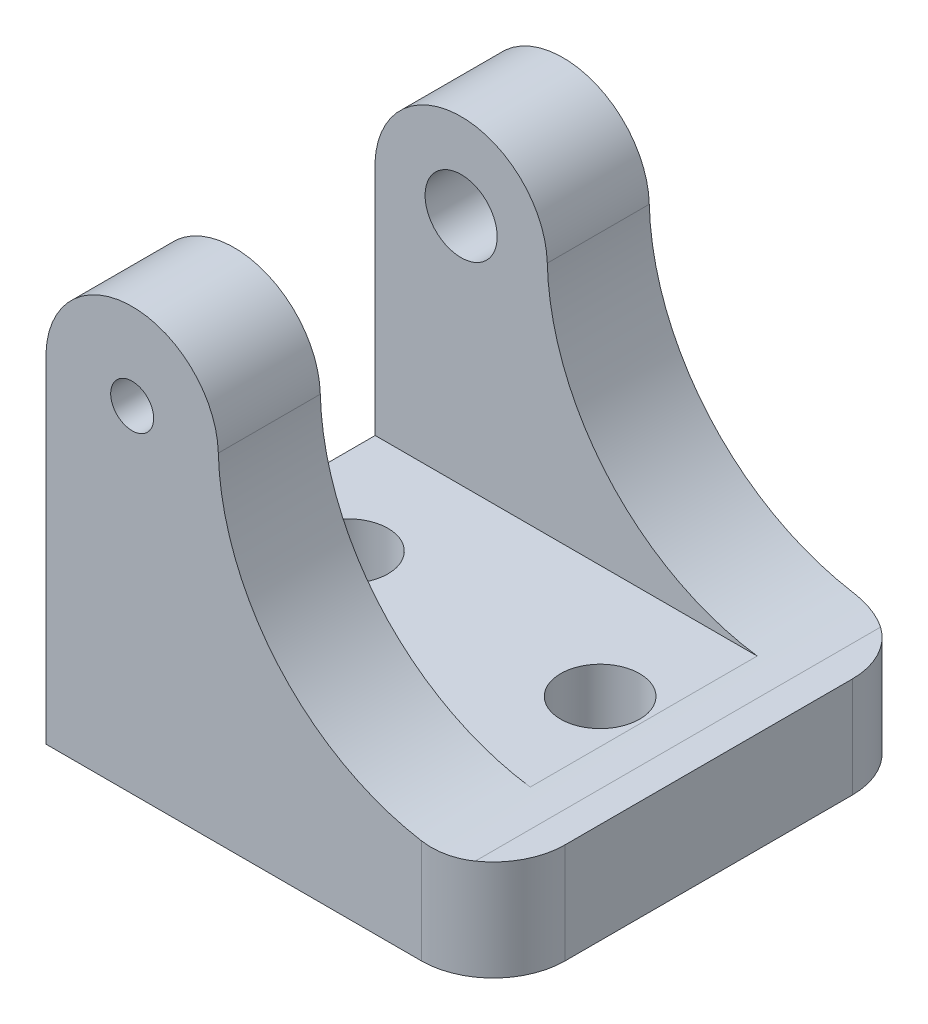
ISO-10303-21;
HEADER;
FILE_DESCRIPTION(('STEP AP214'),'2;1');
FILE_NAME('part.step','',(''),(''),'','','');
FILE_SCHEMA(('AUTOMOTIVE_DESIGN { 1 0 10303 214 1 1 1 1 }'));
ENDSEC;
DATA;
#1=APPLICATION_CONTEXT('core data for automotive mechanical design processes');
#2=APPLICATION_PROTOCOL_DEFINITION('international standard','automotive_design',2000,#1);
#3=PRODUCT_CONTEXT('',#1,'mechanical');
#4=PRODUCT('Part','Part','',(#3));
#5=PRODUCT_RELATED_PRODUCT_CATEGORY('part','',(#4));
#6=PRODUCT_DEFINITION_FORMATION('','',#4);
#7=PRODUCT_DEFINITION_CONTEXT('part definition',#1,'design');
#8=PRODUCT_DEFINITION('design','',#6,#7);
#9=PRODUCT_DEFINITION_SHAPE('','',#8);
#10=(LENGTH_UNIT() NAMED_UNIT(*) SI_UNIT(.MILLI.,.METRE.));
#11=(NAMED_UNIT(*) PLANE_ANGLE_UNIT() SI_UNIT($,.RADIAN.));
#12=(NAMED_UNIT(*) SI_UNIT($,.STERADIAN.) SOLID_ANGLE_UNIT());
#13=UNCERTAINTY_MEASURE_WITH_UNIT(LENGTH_MEASURE(1.E-05),#10,'distance_accuracy_value','');
#14=(GEOMETRIC_REPRESENTATION_CONTEXT(3) GLOBAL_UNCERTAINTY_ASSIGNED_CONTEXT((#13)) GLOBAL_UNIT_ASSIGNED_CONTEXT((#10,
#11,#12)) REPRESENTATION_CONTEXT('',''));
#15=CARTESIAN_POINT('',(0.,0.,0.));
#16=DIRECTION('',(0.,0.,1.));
#17=DIRECTION('',(1.,0.,0.));
#18=AXIS2_PLACEMENT_3D('',#15,#16,#17);
#19=CARTESIAN_POINT('',(-12.1624419840865,29.7023741953259,-38.1));
#20=DIRECTION('',(0.,0.,1.));
#21=DIRECTION('',(1.,0.,0.));
#22=AXIS2_PLACEMENT_3D('',#19,#20,#21);
#23=CYLINDRICAL_SURFACE('',#22,7.62);
#24=DIRECTION('',(0.,0.,1.));
#25=VECTOR('',#24,1.);
#26=CARTESIAN_POINT('',(-4.54514270780545,29.9052331008931,-38.1));
#27=LINE('',#26,#25);
#28=CARTESIAN_POINT('',(-4.54514270780545,29.9052331008931,-9.017));
#29=VERTEX_POINT('',#28);
#30=CARTESIAN_POINT('',(-4.54514270780545,29.9052331008931,0.));
#31=VERTEX_POINT('',#30);
#32=EDGE_CURVE('E189',#29,#31,#27,.T.);
#33=ORIENTED_EDGE('',*,*,#32,.F.);
#34=CARTESIAN_POINT('',(-12.1624419840865,29.7023741953259,-9.017));
#35=DIRECTION('',(0.,0.,1.));
#36=DIRECTION('',(0.,-1.,0.));
#37=AXIS2_PLACEMENT_3D('',#34,#35,#36);
#38=CIRCLE('',#37,7.62);
#39=CARTESIAN_POINT('',(-19.7612,29.1338,-9.017));
#40=VERTEX_POINT('',#39);
#41=EDGE_CURVE('E140',#40,#29,#38,.F.);
#42=ORIENTED_EDGE('',*,*,#41,.F.);
#43=DIRECTION('',(0.,0.,1.));
#44=VECTOR('',#43,1.);
#45=CARTESIAN_POINT('',(-19.7612,29.1338,-38.1));
#46=LINE('',#45,#44);
#47=CARTESIAN_POINT('',(-19.7612,29.1338,0.));
#48=VERTEX_POINT('',#47);
#49=EDGE_CURVE('E153',#40,#48,#46,.T.);
#50=ORIENTED_EDGE('',*,*,#49,.T.);
#51=CARTESIAN_POINT('',(-12.1624419840865,29.7023741953259,0.));
#52=DIRECTION('',(0.,0.,1.));
#53=DIRECTION('',(-1.,0.,0.));
#54=AXIS2_PLACEMENT_3D('',#51,#52,#53);
#55=CIRCLE('',#54,7.62);
#56=EDGE_CURVE('E166',#31,#48,#55,.T.);
#57=ORIENTED_EDGE('',*,*,#56,.F.);
#58=EDGE_LOOP('',(#33,#42,#50,#57));
#59=FACE_BOUND('',#58,.T.);
#60=ADVANCED_FACE('F36',(#59),#23,.T.);
#61=CARTESIAN_POINT('',(-19.7612,0.,-38.1));
#62=DIRECTION('',(-1.,0.,0.));
#63=DIRECTION('',(0.,0.,1.));
#64=AXIS2_PLACEMENT_3D('',#61,#62,#63);
#65=PLANE('',#64);
#66=DIRECTION('',(0.,-1.,0.));
#67=VECTOR('',#66,1.);
#68=CARTESIAN_POINT('',(-19.7612,0.,-29.083));
#69=LINE('',#68,#67);
#70=CARTESIAN_POINT('',(-19.7612,29.1338,-29.083));
#71=VERTEX_POINT('',#70);
#72=CARTESIAN_POINT('',(-19.7612,9.10297419532589,-29.083));
#73=VERTEX_POINT('',#72);
#74=EDGE_CURVE('E156',#71,#73,#69,.T.);
#75=ORIENTED_EDGE('',*,*,#74,.F.);
#76=CARTESIAN_POINT('',(-19.7612,29.1338,-38.1));
#77=VERTEX_POINT('',#76);
#78=EDGE_CURVE('E182',#77,#71,#46,.T.);
#79=ORIENTED_EDGE('',*,*,#78,.F.);
#80=DIRECTION('',(0.,-1.,0.));
#81=VECTOR('',#80,1.);
#82=CARTESIAN_POINT('',(-19.7612,0.,-38.1));
#83=LINE('',#82,#81);
#84=CARTESIAN_POINT('',(-19.7612,0.,-38.1));
#85=VERTEX_POINT('',#84);
#86=EDGE_CURVE('E162',#77,#85,#83,.T.);
#87=ORIENTED_EDGE('',*,*,#86,.T.);
#88=DIRECTION('',(0.,0.,1.));
#89=VECTOR('',#88,1.);
#90=CARTESIAN_POINT('',(-19.7612,0.,-38.1));
#91=LINE('',#90,#89);
#92=CARTESIAN_POINT('',(-19.7612,0.,0.));
#93=VERTEX_POINT('',#92);
#94=EDGE_CURVE('E173',#85,#93,#91,.T.);
#95=ORIENTED_EDGE('',*,*,#94,.T.);
#96=DIRECTION('',(0.,-1.,0.));
#97=VECTOR('',#96,1.);
#98=CARTESIAN_POINT('',(-19.7612,0.,0.));
#99=LINE('',#98,#97);
#100=EDGE_CURVE('E161',#48,#93,#99,.T.);
#101=ORIENTED_EDGE('',*,*,#100,.F.);
#102=ORIENTED_EDGE('',*,*,#49,.F.);
#103=DIRECTION('',(0.,1.,0.));
#104=VECTOR('',#103,1.);
#105=CARTESIAN_POINT('',(-19.7612,0.,-9.01699999999999));
#106=LINE('',#105,#104);
#107=CARTESIAN_POINT('',(-19.7612,9.10297419532589,-9.017));
#108=VERTEX_POINT('',#107);
#109=EDGE_CURVE('E144',#108,#40,#106,.T.);
#110=ORIENTED_EDGE('',*,*,#109,.F.);
#111=DIRECTION('',(0.,0.,1.));
#112=VECTOR('',#111,1.);
#113=CARTESIAN_POINT('',(-19.7612,9.10297419532589,-38.1));
#114=LINE('',#113,#112);
#115=EDGE_CURVE('E130',#73,#108,#114,.T.);
#116=ORIENTED_EDGE('',*,*,#115,.F.);
#117=EDGE_LOOP('',(#75,#79,#87,#95,#101,#102,#110,#116));
#118=FACE_BOUND('',#117,.T.);
#119=ADVANCED_FACE('F151',(#118),#65,.T.);
#120=CARTESIAN_POINT('',(-12.1624419840865,29.7023741953259,-29.083));
#121=DIRECTION('',(0.,0.,-1.));
#122=DIRECTION('',(-1.,0.,0.));
#123=AXIS2_PLACEMENT_3D('',#120,#121,#122);
#124=CIRCLE('',#123,7.62);
#125=CARTESIAN_POINT('',(-4.54514270780545,29.9052331008931,-29.083));
#126=VERTEX_POINT('',#125);
#127=EDGE_CURVE('E154',#126,#71,#124,.F.);
#128=ORIENTED_EDGE('',*,*,#127,.F.);
#129=CARTESIAN_POINT('',(-4.54514270780545,29.9052331008931,-38.1));
#130=VERTEX_POINT('',#129);
#131=EDGE_CURVE('E186',#130,#126,#27,.T.);
#132=ORIENTED_EDGE('',*,*,#131,.F.);
#133=CARTESIAN_POINT('',(-12.1624419840865,29.7023741953259,-38.1));
#134=DIRECTION('',(0.,0.,1.));
#135=DIRECTION('',(-1.,0.,0.));
#136=AXIS2_PLACEMENT_3D('',#133,#134,#135);
#137=CIRCLE('',#136,7.62);
#138=EDGE_CURVE('E170',#130,#77,#137,.T.);
#139=ORIENTED_EDGE('',*,*,#138,.T.);
#140=ORIENTED_EDGE('',*,*,#78,.T.);
#141=EDGE_LOOP('',(#128,#132,#139,#140));
#142=FACE_BOUND('',#141,.T.);
#143=ADVANCED_FACE('F245',(#142),#23,.T.);
#144=CARTESIAN_POINT('',(17.0372052416576,30.48,-38.1));
#145=DIRECTION('',(0.,0.,1.));
#146=DIRECTION('',(1.,0.,0.));
#147=AXIS2_PLACEMENT_3D('',#144,#145,#146);
#148=CYLINDRICAL_SURFACE('',#147,21.59);
#149=DIRECTION('',(0.,0.,1.));
#150=VECTOR('',#149,1.);
#151=CARTESIAN_POINT('',(17.0372052416576,8.89,-38.1));
#152=LINE('',#151,#150);
#153=CARTESIAN_POINT('',(17.0372052416576,8.89,-36.9629248975476));
#154=VERTEX_POINT('',#153);
#155=CARTESIAN_POINT('',(17.0372052416576,8.89,-1.1370751024524));
#156=VERTEX_POINT('',#155);
#157=EDGE_CURVE('E190',#154,#156,#152,.T.);
#158=ORIENTED_EDGE('',*,*,#157,.F.);
#159=CARTESIAN_POINT('',(17.0372052416576,8.89,-36.9629248975476));
#160=CARTESIAN_POINT('',(16.8931415028713,8.88998763684848,-37.063160770611));
#161=CARTESIAN_POINT('',(16.7448908878423,8.89144118584396,-37.157391085304));
#162=CARTESIAN_POINT('',(16.441141277506,8.89769845720492,-37.3332497352878));
#163=CARTESIAN_POINT('',(16.2856414930698,8.90250254510123,-37.4148766944144));
#164=CARTESIAN_POINT('',(15.9726522402385,8.91570640614745,-37.5629749658211));
#165=CARTESIAN_POINT('',(15.8153183028663,8.92400994811984,-37.6297837128549));
#166=CARTESIAN_POINT('',(15.496022299831,8.94448456826907,-37.750427239401));
#167=CARTESIAN_POINT('',(15.3340611026282,8.95665492499205,-37.8042644357979));
#168=CARTESIAN_POINT('',(15.0285847230403,8.98316744856153,-37.8923406938851));
#169=CARTESIAN_POINT('',(14.88550052542,8.99700124388347,-37.9282380772349));
#170=CARTESIAN_POINT('',(14.5975036183752,9.02779888671575,-37.9899415635191));
#171=CARTESIAN_POINT('',(14.4525909398653,9.04476268137232,-38.0157478368308));
#172=CARTESIAN_POINT('',(14.158378199001,9.08226849290067,-38.0576777652804));
#173=CARTESIAN_POINT('',(14.0090538461088,9.10288378645533,-38.0735652573884));
#174=CARTESIAN_POINT('',(13.7101272476129,9.14735785060343,-38.0947331159232));
#175=CARTESIAN_POINT('',(13.5605249869125,9.17121680280358,-38.1000128881811));
#176=CARTESIAN_POINT('',(13.4112,9.19666882305611,-38.1));
#177=B_SPLINE_CURVE_WITH_KNOTS('',3,(#159,#160,#161,#162,#163,#164,#165,#166,#167,#168,#169,
#170,#171,#172,#173,#174,#175,#176),.UNSPECIFIED.,.F.,.F.,(4,2,2,2,2,2,2,2,4),(0.,
0.526366836583321,1.05279110673478,1.56559737929597,2.0783080307723,2.5224270407601,
2.96653855195876,3.4208569174649,3.87520072993903),.UNSPECIFIED.);
#178=CARTESIAN_POINT('',(13.4112,9.19666882305611,-38.1));
#179=VERTEX_POINT('',#178);
#180=EDGE_CURVE('E233',#154,#179,#177,.T.);
#181=ORIENTED_EDGE('',*,*,#180,.T.);
#182=CARTESIAN_POINT('',(17.0372052416576,30.48,-38.1));
#183=DIRECTION('',(0.,0.,-1.));
#184=DIRECTION('',(1.,0.,0.));
#185=AXIS2_PLACEMENT_3D('',#182,#183,#184);
#186=CIRCLE('',#185,21.59);
#187=EDGE_CURVE('E168',#179,#130,#186,.T.);
#188=ORIENTED_EDGE('',*,*,#187,.T.);
#189=ORIENTED_EDGE('',*,*,#131,.T.);
#190=CARTESIAN_POINT('',(17.0372052416576,30.48,-29.083));
#191=DIRECTION('',(0.,0.,-1.));
#192=DIRECTION('',(-1.,0.,0.));
#193=AXIS2_PLACEMENT_3D('',#190,#191,#192);
#194=CIRCLE('',#193,21.59);
#195=CARTESIAN_POINT('',(14.0121651185686,9.10297419532591,-29.083));
#196=VERTEX_POINT('',#195);
#197=EDGE_CURVE('E201',#196,#126,#194,.T.);
#198=ORIENTED_EDGE('',*,*,#197,.F.);
#199=DIRECTION('',(0.,0.,1.));
#200=VECTOR('',#199,1.);
#201=CARTESIAN_POINT('',(14.0121651185686,9.10297419532591,-38.1));
#202=LINE('',#201,#200);
#203=CARTESIAN_POINT('',(14.0121651185686,9.10297419532591,-9.017));
#204=VERTEX_POINT('',#203);
#205=EDGE_CURVE('E185',#204,#196,#202,.F.);
#206=ORIENTED_EDGE('',*,*,#205,.F.);
#207=CARTESIAN_POINT('',(17.0372052416576,30.48,-9.017));
#208=DIRECTION('',(0.,0.,1.));
#209=DIRECTION('',(0.,-1.,0.));
#210=AXIS2_PLACEMENT_3D('',#207,#208,#209);
#211=CIRCLE('',#210,21.59);
#212=EDGE_CURVE('E147',#29,#204,#211,.T.);
#213=ORIENTED_EDGE('',*,*,#212,.F.);
#214=ORIENTED_EDGE('',*,*,#32,.T.);
#215=CARTESIAN_POINT('',(17.0372052416576,30.48,0.));
#216=DIRECTION('',(0.,0.,-1.));
#217=DIRECTION('',(1.,0.,0.));
#218=AXIS2_PLACEMENT_3D('',#215,#216,#217);
#219=CIRCLE('',#218,21.59);
#220=CARTESIAN_POINT('',(13.4112,9.19666882305611,0.));
#221=VERTEX_POINT('',#220);
#222=EDGE_CURVE('E178',#221,#31,#219,.T.);
#223=ORIENTED_EDGE('',*,*,#222,.F.);
#224=CARTESIAN_POINT('',(13.4112,9.19666882305611,0.));
#225=CARTESIAN_POINT('',(13.5842252192535,9.1671693741161,2.40591076720246E-05));
#226=CARTESIAN_POINT('',(13.7576277541459,9.13981899073767,-0.00707109032502442));
#227=CARTESIAN_POINT('',(14.1039145829073,9.08948163111424,-0.0355127757351594));
#228=CARTESIAN_POINT('',(14.2767988191825,9.06649512329994,-0.0568608405510777));
#229=CARTESIAN_POINT('',(14.6162910369309,9.02549427447236,-0.113084783871374));
#230=CARTESIAN_POINT('',(14.7829457028252,9.00736671812725,-0.147596529410407));
#231=CARTESIAN_POINT('',(15.1132933508516,8.97525221329142,-0.230004618226908));
#232=CARTESIAN_POINT('',(15.2769868749063,8.96126449981516,-0.277898485490002));
#233=CARTESIAN_POINT('',(15.5785685800954,8.93887206641993,-0.379503076486314));
#234=CARTESIAN_POINT('',(15.716975332757,8.92997038229936,-0.431574293600448));
#235=CARTESIAN_POINT('',(15.989947420612,8.9149811792621,-0.545310187399221));
#236=CARTESIAN_POINT('',(16.1245128163144,8.90889361599443,-0.606974712871384));
#237=CARTESIAN_POINT('',(16.3921188431343,8.89921495807326,-0.74112073697719));
#238=CARTESIAN_POINT('',(16.5250533609667,8.89568445161754,-0.813818259128751));
#239=CARTESIAN_POINT('',(16.785430981764,8.89107364016084,-0.968546394018817));
#240=CARTESIAN_POINT('',(16.9128737472261,8.88999348553936,-1.05057757924517));
#241=CARTESIAN_POINT('',(17.0372052416576,8.89,-1.1370751024524));
#242=B_SPLINE_CURVE_WITH_KNOTS('',3,(#224,#225,#226,#227,#228,#229,#230,#231,#232,#233,#234,
#235,#236,#237,#238,#239,#240,#241),.UNSPECIFIED.,.F.,.F.,(4,2,2,2,2,2,2,2,4),(0.,
0.52642632669727,1.05290912957047,1.56577610101067,2.07854824249167,2.52260711440877,
2.96665898765166,3.42091591287959,3.87520071536177),.UNSPECIFIED.);
#243=EDGE_CURVE('E226',#221,#156,#242,.T.);
#244=ORIENTED_EDGE('',*,*,#243,.T.);
#245=EDGE_LOOP('',(#158,#181,#188,#189,#198,#206,#213,#214,#223,#244));
#246=FACE_BOUND('',#245,.T.);
#247=ADVANCED_FACE('F239',(#246),#148,.F.);
#248=CARTESIAN_POINT('',(17.0372052416576,8.89,-38.1));
#249=DIRECTION('',(0.,1.,0.));
#250=DIRECTION('',(-1.,0.,0.));
#251=AXIS2_PLACEMENT_3D('',#248,#249,#250);
#252=PLANE('',#251);
#253=DIRECTION('',(0.,0.,1.));
#254=VECTOR('',#253,1.);
#255=CARTESIAN_POINT('',(19.7612,8.89,-38.1));
#256=LINE('',#255,#254);
#257=CARTESIAN_POINT('',(19.7612,8.89,-31.75));
#258=VERTEX_POINT('',#257);
#259=CARTESIAN_POINT('',(19.7612,8.89,-6.35000000000002));
#260=VERTEX_POINT('',#259);
#261=EDGE_CURVE('E193',#258,#260,#256,.T.);
#262=ORIENTED_EDGE('',*,*,#261,.F.);
#263=CARTESIAN_POINT('',(13.4112,8.89,-31.75));
#264=DIRECTION('',(0.,1.,0.));
#265=DIRECTION('',(-1.,0.,0.));
#266=AXIS2_PLACEMENT_3D('',#263,#264,#265);
#267=CIRCLE('',#266,6.35);
#268=EDGE_CURVE('E224',#258,#154,#267,.T.);
#269=ORIENTED_EDGE('',*,*,#268,.T.);
#270=ORIENTED_EDGE('',*,*,#157,.T.);
#271=CARTESIAN_POINT('',(13.4112,8.89,-6.35));
#272=DIRECTION('',(0.,1.,0.));
#273=DIRECTION('',(-1.,0.,0.));
#274=AXIS2_PLACEMENT_3D('',#271,#272,#273);
#275=CIRCLE('',#274,6.35);
#276=EDGE_CURVE('E222',#156,#260,#275,.T.);
#277=ORIENTED_EDGE('',*,*,#276,.T.);
#278=EDGE_LOOP('',(#262,#269,#270,#277));
#279=FACE_BOUND('',#278,.T.);
#280=ADVANCED_FACE('F244',(#279),#252,.T.);
#281=CARTESIAN_POINT('',(19.7612,8.89,-38.1));
#282=DIRECTION('',(1.,0.,0.));
#283=DIRECTION('',(0.,1.,0.));
#284=AXIS2_PLACEMENT_3D('',#281,#282,#283);
#285=PLANE('',#284);
#286=DIRECTION('',(0.,0.,1.));
#287=VECTOR('',#286,1.);
#288=CARTESIAN_POINT('',(19.7612,0.,-38.1));
#289=LINE('',#288,#287);
#290=CARTESIAN_POINT('',(19.7612,0.,-31.75));
#291=VERTEX_POINT('',#290);
#292=CARTESIAN_POINT('',(19.7612,0.,-6.35000000000002));
#293=VERTEX_POINT('',#292);
#294=EDGE_CURVE('E196',#291,#293,#289,.T.);
#295=ORIENTED_EDGE('',*,*,#294,.F.);
#296=DIRECTION('',(0.,1.,0.));
#297=VECTOR('',#296,1.);
#298=CARTESIAN_POINT('',(19.7612,8.89,-31.75));
#299=LINE('',#298,#297);
#300=EDGE_CURVE('E219',#291,#258,#299,.T.);
#301=ORIENTED_EDGE('',*,*,#300,.T.);
#302=ORIENTED_EDGE('',*,*,#261,.T.);
#303=DIRECTION('',(0.,1.,0.));
#304=VECTOR('',#303,1.);
#305=CARTESIAN_POINT('',(19.7612,0.,-6.35));
#306=LINE('',#305,#304);
#307=EDGE_CURVE('E204',#260,#293,#306,.F.);
#308=ORIENTED_EDGE('',*,*,#307,.T.);
#309=EDGE_LOOP('',(#295,#301,#302,#308));
#310=FACE_BOUND('',#309,.T.);
#311=ADVANCED_FACE('F251',(#310),#285,.T.);
#312=CARTESIAN_POINT('',(-19.7612,0.,-38.1));
#313=DIRECTION('',(0.,-1.,0.));
#314=DIRECTION('',(1.,0.,0.));
#315=AXIS2_PLACEMENT_3D('',#312,#313,#314);
#316=PLANE('',#315);
#317=CARTESIAN_POINT('',(10.16,0.,-19.05));
#318=DIRECTION('',(0.,-1.,0.));
#319=DIRECTION('',(1.,0.,0.));
#320=AXIS2_PLACEMENT_3D('',#317,#318,#319);
#321=CIRCLE('',#320,3.4925);
#322=CARTESIAN_POINT('',(13.6525,0.,-19.05));
#323=VERTEX_POINT('',#322);
#324=EDGE_CURVE('E217',#323,#323,#321,.T.);
#325=ORIENTED_EDGE('',*,*,#324,.F.);
#326=EDGE_LOOP('',(#325));
#327=FACE_BOUND('',#326,.T.);
#328=CARTESIAN_POINT('',(-12.0904,0.,-19.05));
#329=DIRECTION('',(0.,-1.,0.));
#330=DIRECTION('',(1.,0.,0.));
#331=AXIS2_PLACEMENT_3D('',#328,#329,#330);
#332=CIRCLE('',#331,3.4925);
#333=CARTESIAN_POINT('',(-8.5979,0.,-19.05));
#334=VERTEX_POINT('',#333);
#335=EDGE_CURVE('E213',#334,#334,#332,.T.);
#336=ORIENTED_EDGE('',*,*,#335,.F.);
#337=EDGE_LOOP('',(#336));
#338=FACE_BOUND('',#337,.T.);
#339=DIRECTION('',(1.,0.,0.));
#340=VECTOR('',#339,1.);
#341=CARTESIAN_POINT('',(-19.7612,0.,-38.1));
#342=LINE('',#341,#340);
#343=CARTESIAN_POINT('',(13.4112,0.,-38.1));
#344=VERTEX_POINT('',#343);
#345=EDGE_CURVE('E165',#85,#344,#342,.T.);
#346=ORIENTED_EDGE('',*,*,#345,.T.);
#347=CARTESIAN_POINT('',(13.4112,0.,-31.75));
#348=DIRECTION('',(0.,-1.,0.));
#349=DIRECTION('',(1.,0.,0.));
#350=AXIS2_PLACEMENT_3D('',#347,#348,#349);
#351=CIRCLE('',#350,6.35);
#352=EDGE_CURVE('E45',#344,#291,#351,.T.);
#353=ORIENTED_EDGE('',*,*,#352,.T.);
#354=ORIENTED_EDGE('',*,*,#294,.T.);
#355=CARTESIAN_POINT('',(13.4112,0.,-6.35));
#356=DIRECTION('',(0.,-1.,0.));
#357=DIRECTION('',(1.,0.,0.));
#358=AXIS2_PLACEMENT_3D('',#355,#356,#357);
#359=CIRCLE('',#358,6.35);
#360=CARTESIAN_POINT('',(13.4112,0.,0.));
#361=VERTEX_POINT('',#360);
#362=EDGE_CURVE('E52',#293,#361,#359,.T.);
#363=ORIENTED_EDGE('',*,*,#362,.T.);
#364=DIRECTION('',(1.,0.,0.));
#365=VECTOR('',#364,1.);
#366=CARTESIAN_POINT('',(-19.7612,0.,0.));
#367=LINE('',#366,#365);
#368=EDGE_CURVE('E176',#93,#361,#367,.T.);
#369=ORIENTED_EDGE('',*,*,#368,.F.);
#370=ORIENTED_EDGE('',*,*,#94,.F.);
#371=EDGE_LOOP('',(#346,#353,#354,#363,#369,#370));
#372=FACE_BOUND('',#371,.T.);
#373=ADVANCED_FACE('F255',(#327,#338,#372),#316,.T.);
#374=CARTESIAN_POINT('',(-12.1624419840865,29.7023741953259,-38.1));
#375=DIRECTION('',(0.,0.,-1.));
#376=DIRECTION('',(-1.,0.,0.));
#377=AXIS2_PLACEMENT_3D('',#374,#375,#376);
#378=PLANE('',#377);
#379=CARTESIAN_POINT('',(-12.1624419840865,29.7023741953259,-38.1));
#380=DIRECTION('',(0.,0.,-1.));
#381=DIRECTION('',(-1.,0.,0.));
#382=AXIS2_PLACEMENT_3D('',#379,#380,#381);
#383=CIRCLE('',#382,5.1308);
#384=CARTESIAN_POINT('',(-17.2932419840865,29.7023741953259,-38.1));
#385=VERTEX_POINT('',#384);
#386=EDGE_CURVE('E212',#385,#385,#383,.T.);
#387=ORIENTED_EDGE('',*,*,#386,.F.);
#388=EDGE_LOOP('',(#387));
#389=FACE_BOUND('',#388,.T.);
#390=ORIENTED_EDGE('',*,*,#187,.F.);
#391=DIRECTION('',(0.,1.,0.));
#392=VECTOR('',#391,1.);
#393=CARTESIAN_POINT('',(13.4112,29.7023741953259,-38.1));
#394=LINE('',#393,#392);
#395=EDGE_CURVE('E60',#179,#344,#394,.F.);
#396=ORIENTED_EDGE('',*,*,#395,.T.);
#397=ORIENTED_EDGE('',*,*,#345,.F.);
#398=ORIENTED_EDGE('',*,*,#86,.F.);
#399=ORIENTED_EDGE('',*,*,#138,.F.);
#400=EDGE_LOOP('',(#390,#396,#397,#398,#399));
#401=FACE_BOUND('',#400,.T.);
#402=ADVANCED_FACE('F259',(#389,#401),#378,.T.);
#403=CARTESIAN_POINT('',(-12.1624419840865,29.7023741953259,0.));
#404=DIRECTION('',(0.,0.,-1.));
#405=DIRECTION('',(-1.,0.,0.));
#406=AXIS2_PLACEMENT_3D('',#403,#404,#405);
#407=PLANE('',#406);
#408=CARTESIAN_POINT('',(-12.1624419840865,29.7023741953259,0.));
#409=DIRECTION('',(0.,0.,1.));
#410=DIRECTION('',(1.,0.,0.));
#411=AXIS2_PLACEMENT_3D('',#408,#409,#410);
#412=CIRCLE('',#411,1.89864999999999);
#413=CARTESIAN_POINT('',(-10.2637919840865,29.7023741953259,0.));
#414=VERTEX_POINT('',#413);
#415=EDGE_CURVE('E208',#414,#414,#412,.T.);
#416=ORIENTED_EDGE('',*,*,#415,.F.);
#417=EDGE_LOOP('',(#416));
#418=FACE_BOUND('',#417,.T.);
#419=ORIENTED_EDGE('',*,*,#368,.T.);
#420=DIRECTION('',(0.,1.,0.));
#421=VECTOR('',#420,1.);
#422=CARTESIAN_POINT('',(13.4112,8.89,0.));
#423=LINE('',#422,#421);
#424=EDGE_CURVE('E11',#361,#221,#423,.T.);
#425=ORIENTED_EDGE('',*,*,#424,.T.);
#426=ORIENTED_EDGE('',*,*,#222,.T.);
#427=ORIENTED_EDGE('',*,*,#56,.T.);
#428=ORIENTED_EDGE('',*,*,#100,.T.);
#429=EDGE_LOOP('',(#419,#425,#426,#427,#428));
#430=FACE_BOUND('',#429,.T.);
#431=ADVANCED_FACE('F303',(#418,#430),#407,.F.);
#432=CARTESIAN_POINT('',(19.7612,9.10297419532592,-29.083));
#433=DIRECTION('',(0.,0.,-1.));
#434=DIRECTION('',(-1.,0.,0.));
#435=AXIS2_PLACEMENT_3D('',#432,#433,#434);
#436=PLANE('',#435);
#437=CARTESIAN_POINT('',(-12.1624419840865,29.7023741953259,-29.083));
#438=DIRECTION('',(0.,0.,-1.));
#439=DIRECTION('',(-1.,0.,0.));
#440=AXIS2_PLACEMENT_3D('',#437,#438,#439);
#441=CIRCLE('',#440,3.1877);
#442=CARTESIAN_POINT('',(-15.3501419840865,29.7023741953259,-29.083));
#443=VERTEX_POINT('',#442);
#444=EDGE_CURVE('E360',#443,#443,#441,.T.);
#445=ORIENTED_EDGE('',*,*,#444,.T.);
#446=EDGE_LOOP('',(#445));
#447=FACE_BOUND('',#446,.T.);
#448=ORIENTED_EDGE('',*,*,#74,.T.);
#449=DIRECTION('',(-1.,0.,0.));
#450=VECTOR('',#449,1.);
#451=CARTESIAN_POINT('',(19.7612,9.10297419532592,-29.083));
#452=LINE('',#451,#450);
#453=EDGE_CURVE('E136',#196,#73,#452,.T.);
#454=ORIENTED_EDGE('',*,*,#453,.F.);
#455=ORIENTED_EDGE('',*,*,#197,.T.);
#456=ORIENTED_EDGE('',*,*,#127,.T.);
#457=EDGE_LOOP('',(#448,#454,#455,#456));
#458=FACE_BOUND('',#457,.T.);
#459=ADVANCED_FACE('F289',(#447,#458),#436,.F.);
#460=CARTESIAN_POINT('',(19.7612,37.3223741953259,-9.017));
#461=DIRECTION('',(0.,0.,1.));
#462=DIRECTION('',(0.,-1.,0.));
#463=AXIS2_PLACEMENT_3D('',#460,#461,#462);
#464=PLANE('',#463);
#465=CARTESIAN_POINT('',(-12.1624419840865,29.7023741953259,-9.017));
#466=DIRECTION('',(0.,0.,1.));
#467=DIRECTION('',(0.,-1.,0.));
#468=AXIS2_PLACEMENT_3D('',#465,#466,#467);
#469=CIRCLE('',#468,1.89864999999999);
#470=CARTESIAN_POINT('',(-12.1624419840865,27.8037241953259,-9.017));
#471=VERTEX_POINT('',#470);
#472=EDGE_CURVE('E205',#471,#471,#469,.T.);
#473=ORIENTED_EDGE('',*,*,#472,.T.);
#474=EDGE_LOOP('',(#473));
#475=FACE_BOUND('',#474,.T.);
#476=ORIENTED_EDGE('',*,*,#109,.T.);
#477=ORIENTED_EDGE('',*,*,#41,.T.);
#478=ORIENTED_EDGE('',*,*,#212,.T.);
#479=DIRECTION('',(-1.,0.,0.));
#480=VECTOR('',#479,1.);
#481=CARTESIAN_POINT('',(19.7612,9.10297419532592,-9.017));
#482=LINE('',#481,#480);
#483=EDGE_CURVE('E133',#204,#108,#482,.T.);
#484=ORIENTED_EDGE('',*,*,#483,.T.);
#485=EDGE_LOOP('',(#476,#477,#478,#484));
#486=FACE_BOUND('',#485,.T.);
#487=ADVANCED_FACE('F143',(#475,#486),#464,.F.);
#488=CARTESIAN_POINT('',(19.7612,9.10297419532592,-9.017));
#489=DIRECTION('',(0.,-1.,0.));
#490=DIRECTION('',(1.,0.,0.));
#491=AXIS2_PLACEMENT_3D('',#488,#489,#490);
#492=PLANE('',#491);
#493=CARTESIAN_POINT('',(10.16,9.10297419532591,-19.05));
#494=DIRECTION('',(0.,-1.,0.));
#495=DIRECTION('',(1.,0.,0.));
#496=AXIS2_PLACEMENT_3D('',#493,#494,#495);
#497=CIRCLE('',#496,3.4925);
#498=CARTESIAN_POINT('',(13.6525,9.10297419532591,-19.05));
#499=VERTEX_POINT('',#498);
#500=EDGE_CURVE('E214',#499,#499,#497,.T.);
#501=ORIENTED_EDGE('',*,*,#500,.T.);
#502=EDGE_LOOP('',(#501));
#503=FACE_BOUND('',#502,.T.);
#504=CARTESIAN_POINT('',(-12.0904,9.1029741953259,-19.05));
#505=DIRECTION('',(0.,-1.,0.));
#506=DIRECTION('',(1.,0.,0.));
#507=AXIS2_PLACEMENT_3D('',#504,#505,#506);
#508=CIRCLE('',#507,3.4925);
#509=CARTESIAN_POINT('',(-8.59790000000001,9.1029741953259,-19.05));
#510=VERTEX_POINT('',#509);
#511=EDGE_CURVE('E209',#510,#510,#508,.T.);
#512=ORIENTED_EDGE('',*,*,#511,.T.);
#513=EDGE_LOOP('',(#512));
#514=FACE_BOUND('',#513,.T.);
#515=ORIENTED_EDGE('',*,*,#115,.T.);
#516=ORIENTED_EDGE('',*,*,#483,.F.);
#517=ORIENTED_EDGE('',*,*,#205,.T.);
#518=ORIENTED_EDGE('',*,*,#453,.T.);
#519=EDGE_LOOP('',(#515,#516,#517,#518));
#520=FACE_BOUND('',#519,.T.);
#521=ADVANCED_FACE('F132',(#503,#514,#520),#492,.F.);
#522=CARTESIAN_POINT('',(-12.1624419840865,29.7023741953259,0.));
#523=DIRECTION('',(0.,0.,1.));
#524=DIRECTION('',(1.,0.,0.));
#525=AXIS2_PLACEMENT_3D('',#522,#523,#524);
#526=CYLINDRICAL_SURFACE('',#525,1.89864999999999);
#527=ORIENTED_EDGE('',*,*,#415,.T.);
#528=EDGE_LOOP('',(#527));
#529=FACE_BOUND('',#528,.T.);
#530=ORIENTED_EDGE('',*,*,#472,.F.);
#531=EDGE_LOOP('',(#530));
#532=FACE_BOUND('',#531,.T.);
#533=ADVANCED_FACE('F319',(#529,#532),#526,.F.);
#534=CARTESIAN_POINT('',(-12.1624419840865,29.7023741953259,-38.1));
#535=DIRECTION('',(0.,0.,-1.));
#536=DIRECTION('',(-1.,0.,0.));
#537=AXIS2_PLACEMENT_3D('',#534,#535,#536);
#538=CYLINDRICAL_SURFACE('',#537,3.1877);
#539=ORIENTED_EDGE('',*,*,#444,.F.);
#540=EDGE_LOOP('',(#539));
#541=FACE_BOUND('',#540,.T.);
#542=CARTESIAN_POINT('',(-12.1624419840865,29.7023741953259,-34.2138));
#543=DIRECTION('',(0.,0.,-1.));
#544=DIRECTION('',(-1.,0.,0.));
#545=AXIS2_PLACEMENT_3D('',#542,#543,#544);
#546=CIRCLE('',#545,3.1877);
#547=CARTESIAN_POINT('',(-15.3501419840865,29.7023741953259,-34.2138));
#548=VERTEX_POINT('',#547);
#549=EDGE_CURVE('E357',#548,#548,#546,.T.);
#550=ORIENTED_EDGE('',*,*,#549,.T.);
#551=EDGE_LOOP('',(#550));
#552=FACE_BOUND('',#551,.T.);
#553=ADVANCED_FACE('F326',(#541,#552),#538,.F.);
#554=CARTESIAN_POINT('',(-8.97474198408651,29.7023741953259,-34.2138));
#555=DIRECTION('',(0.,0.,1.));
#556=DIRECTION('',(1.,0.,0.));
#557=AXIS2_PLACEMENT_3D('',#554,#555,#556);
#558=PLANE('',#557);
#559=ORIENTED_EDGE('',*,*,#549,.F.);
#560=EDGE_LOOP('',(#559));
#561=FACE_BOUND('',#560,.T.);
#562=CARTESIAN_POINT('',(-12.1624419840865,29.7023741953259,-34.2138));
#563=DIRECTION('',(0.,0.,-1.));
#564=DIRECTION('',(-1.,0.,0.));
#565=AXIS2_PLACEMENT_3D('',#562,#563,#564);
#566=CIRCLE('',#565,5.1308);
#567=CARTESIAN_POINT('',(-17.2932419840865,29.7023741953259,-34.2138));
#568=VERTEX_POINT('',#567);
#569=EDGE_CURVE('E354',#568,#568,#566,.T.);
#570=ORIENTED_EDGE('',*,*,#569,.T.);
#571=EDGE_LOOP('',(#570));
#572=FACE_BOUND('',#571,.T.);
#573=ADVANCED_FACE('F330',(#561,#572),#558,.F.);
#574=CARTESIAN_POINT('',(-12.1624419840865,29.7023741953259,-38.1));
#575=DIRECTION('',(0.,0.,-1.));
#576=DIRECTION('',(-1.,0.,0.));
#577=AXIS2_PLACEMENT_3D('',#574,#575,#576);
#578=CYLINDRICAL_SURFACE('',#577,5.1308);
#579=ORIENTED_EDGE('',*,*,#569,.F.);
#580=EDGE_LOOP('',(#579));
#581=FACE_BOUND('',#580,.T.);
#582=ORIENTED_EDGE('',*,*,#386,.T.);
#583=EDGE_LOOP('',(#582));
#584=FACE_BOUND('',#583,.T.);
#585=ADVANCED_FACE('F334',(#581,#584),#578,.F.);
#586=CARTESIAN_POINT('',(-12.0904,37.3223741953259,-19.05));
#587=DIRECTION('',(0.,-1.,0.));
#588=DIRECTION('',(1.,0.,0.));
#589=AXIS2_PLACEMENT_3D('',#586,#587,#588);
#590=CYLINDRICAL_SURFACE('',#589,3.4925);
#591=ORIENTED_EDGE('',*,*,#335,.T.);
#592=EDGE_LOOP('',(#591));
#593=FACE_BOUND('',#592,.T.);
#594=ORIENTED_EDGE('',*,*,#511,.F.);
#595=EDGE_LOOP('',(#594));
#596=FACE_BOUND('',#595,.T.);
#597=ADVANCED_FACE('F272',(#593,#596),#590,.F.);
#598=CARTESIAN_POINT('',(10.16,37.3223741953259,-19.05));
#599=DIRECTION('',(0.,-1.,0.));
#600=DIRECTION('',(1.,0.,0.));
#601=AXIS2_PLACEMENT_3D('',#598,#599,#600);
#602=CYLINDRICAL_SURFACE('',#601,3.4925);
#603=ORIENTED_EDGE('',*,*,#324,.T.);
#604=EDGE_LOOP('',(#603));
#605=FACE_BOUND('',#604,.T.);
#606=ORIENTED_EDGE('',*,*,#500,.F.);
#607=EDGE_LOOP('',(#606));
#608=FACE_BOUND('',#607,.T.);
#609=ADVANCED_FACE('F265',(#605,#608),#602,.F.);
#610=CARTESIAN_POINT('',(13.4112,8.89,-31.75));
#611=DIRECTION('',(0.,1.,0.));
#612=DIRECTION('',(-1.,0.,0.));
#613=AXIS2_PLACEMENT_3D('',#610,#611,#612);
#614=CYLINDRICAL_SURFACE('',#613,6.35);
#615=ORIENTED_EDGE('',*,*,#352,.F.);
#616=ORIENTED_EDGE('',*,*,#395,.F.);
#617=ORIENTED_EDGE('',*,*,#180,.F.);
#618=ORIENTED_EDGE('',*,*,#268,.F.);
#619=ORIENTED_EDGE('',*,*,#300,.F.);
#620=EDGE_LOOP('',(#615,#616,#617,#618,#619));
#621=FACE_BOUND('',#620,.T.);
#622=ADVANCED_FACE('F262',(#621),#614,.T.);
#623=CARTESIAN_POINT('',(13.4112,29.7023741953259,-6.35));
#624=DIRECTION('',(0.,-1.,0.));
#625=DIRECTION('',(1.,0.,0.));
#626=AXIS2_PLACEMENT_3D('',#623,#624,#625);
#627=CYLINDRICAL_SURFACE('',#626,6.35);
#628=ORIENTED_EDGE('',*,*,#362,.F.);
#629=ORIENTED_EDGE('',*,*,#307,.F.);
#630=ORIENTED_EDGE('',*,*,#276,.F.);
#631=ORIENTED_EDGE('',*,*,#243,.F.);
#632=ORIENTED_EDGE('',*,*,#424,.F.);
#633=EDGE_LOOP('',(#628,#629,#630,#631,#632));
#634=FACE_BOUND('',#633,.T.);
#635=ADVANCED_FACE('F38',(#634),#627,.T.);
#636=CLOSED_SHELL('',(#60,#119,#143,#247,#280,#311,#373,#402,#431,#459,#487,#521,#533,#553,#573,
#585,#597,#609,#622,#635));
#637=MANIFOLD_SOLID_BREP('B2',#636);
#638=ADVANCED_BREP_SHAPE_REPRESENTATION('',(#18,#637),#14);
#639=SHAPE_DEFINITION_REPRESENTATION(#9,#638);
ENDSEC;
END-ISO-10303-21;
